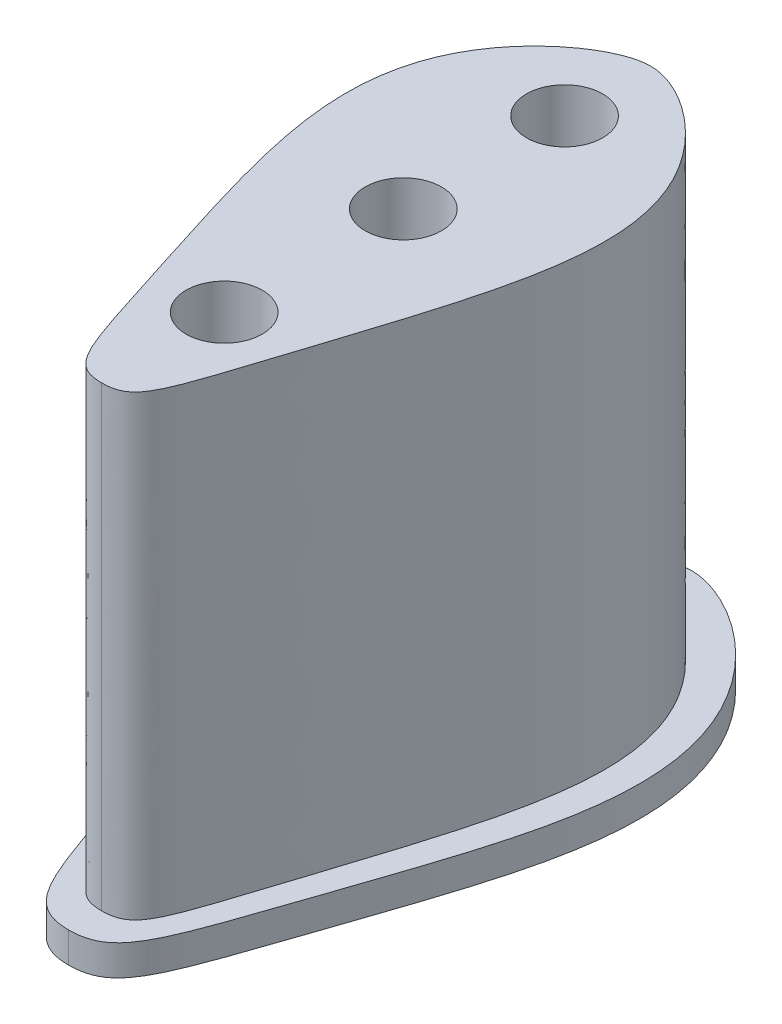
ISO-10303-21;
HEADER;
FILE_DESCRIPTION(('STEP AP214'),'2;1');
FILE_NAME('part.step','',(''),(''),'','','');
FILE_SCHEMA(('AUTOMOTIVE_DESIGN { 1 0 10303 214 1 1 1 1 }'));
ENDSEC;
DATA;
#1=APPLICATION_CONTEXT('core data for automotive mechanical design processes');
#2=APPLICATION_PROTOCOL_DEFINITION('international standard','automotive_design',2000,#1);
#3=PRODUCT_CONTEXT('',#1,'mechanical');
#4=PRODUCT('Part','Part','',(#3));
#5=PRODUCT_RELATED_PRODUCT_CATEGORY('part','',(#4));
#6=PRODUCT_DEFINITION_FORMATION('','',#4);
#7=PRODUCT_DEFINITION_CONTEXT('part definition',#1,'design');
#8=PRODUCT_DEFINITION('design','',#6,#7);
#9=PRODUCT_DEFINITION_SHAPE('','',#8);
#10=(LENGTH_UNIT() NAMED_UNIT(*) SI_UNIT(.MILLI.,.METRE.));
#11=(NAMED_UNIT(*) PLANE_ANGLE_UNIT() SI_UNIT($,.RADIAN.));
#12=(NAMED_UNIT(*) SI_UNIT($,.STERADIAN.) SOLID_ANGLE_UNIT());
#13=UNCERTAINTY_MEASURE_WITH_UNIT(LENGTH_MEASURE(1.E-05),#10,'distance_accuracy_value','');
#14=(GEOMETRIC_REPRESENTATION_CONTEXT(3) GLOBAL_UNCERTAINTY_ASSIGNED_CONTEXT((#13)) GLOBAL_UNIT_ASSIGNED_CONTEXT((#10,
#11,#12)) REPRESENTATION_CONTEXT('',''));
#15=CARTESIAN_POINT('',(0.,0.,0.));
#16=DIRECTION('',(0.,0.,1.));
#17=DIRECTION('',(1.,0.,0.));
#18=AXIS2_PLACEMENT_3D('',#15,#16,#17);
#19=CARTESIAN_POINT('',(0.12286504058619,32.,-38.2384665260502));
#20=CARTESIAN_POINT('',(-4.97587389575558,32.,-38.2414873686948));
#21=CARTESIAN_POINT('',(-13.5003142261998,32.,-27.3530555676864));
#22=CARTESIAN_POINT('',(-10.5685583705486,32.,-26.1997976414068));
#23=CARTESIAN_POINT('',(-0.852682464661893,32.,-7.55709148616971));
#24=CARTESIAN_POINT('',(-4.49606017056606,32.,-2.23526174369485));
#25=CARTESIAN_POINT('',(0.101532658938724,32.,-2.23253781437521));
#26=B_SPLINE_CURVE_WITH_KNOTS('',6,(#19,#20,#21,#22,#23,#24,#25),.UNSPECIFIED.,.F.,.F.,(7,7),
(0.,1.),.UNSPECIFIED.);
#27=DIRECTION('',(0.,-1.,0.));
#28=VECTOR('',#27,1.);
#29=SURFACE_OF_LINEAR_EXTRUSION('',#26,#28);
#30=DIRECTION('',(0.,-1.,0.));
#31=VECTOR('',#30,1.);
#32=CARTESIAN_POINT('',(0.122865040586191,32.,-38.2384665260502));
#33=LINE('',#32,#31);
#34=CARTESIAN_POINT('',(0.122865040586191,32.,-38.2384665260502));
#35=VERTEX_POINT('',#34);
#36=CARTESIAN_POINT('',(0.122865040586191,2.,-38.2384665260502));
#37=VERTEX_POINT('',#36);
#38=EDGE_CURVE('E54',#35,#37,#33,.T.);
#39=ORIENTED_EDGE('',*,*,#38,.T.);
#40=CARTESIAN_POINT('',(0.12286504058619,2.,-38.2384665260502));
#41=CARTESIAN_POINT('',(-4.97587389575558,2.,-38.2414873686948));
#42=CARTESIAN_POINT('',(-13.5003142261998,2.,-27.3530555676864));
#43=CARTESIAN_POINT('',(-10.5685583705486,2.,-26.1997976414068));
#44=CARTESIAN_POINT('',(-0.852682464661893,2.,-7.55709148616971));
#45=CARTESIAN_POINT('',(-4.49606017056606,2.,-2.23526174369485));
#46=CARTESIAN_POINT('',(0.101532658938724,2.,-2.23253781437521));
#47=B_SPLINE_CURVE_WITH_KNOTS('',6,(#40,#41,#42,#43,#44,#45,#46),.UNSPECIFIED.,.F.,.F.,(7,7),
(0.,1.),.UNSPECIFIED.);
#48=CARTESIAN_POINT('',(0.101532658938724,2.,-2.23253781437521));
#49=VERTEX_POINT('',#48);
#50=EDGE_CURVE('E88',#37,#49,#47,.T.);
#51=ORIENTED_EDGE('',*,*,#50,.T.);
#52=DIRECTION('',(0.,-1.,0.));
#53=VECTOR('',#52,1.);
#54=CARTESIAN_POINT('',(0.101532658938724,32.,-2.23253781437521));
#55=LINE('',#54,#53);
#56=CARTESIAN_POINT('',(0.101532658938724,32.,-2.23253781437521));
#57=VERTEX_POINT('',#56);
#58=EDGE_CURVE('E11',#57,#49,#55,.T.);
#59=ORIENTED_EDGE('',*,*,#58,.F.);
#60=EDGE_CURVE('E153',#35,#57,#26,.T.);
#61=ORIENTED_EDGE('',*,*,#60,.F.);
#62=EDGE_LOOP('',(#39,#51,#59,#61));
#63=FACE_BOUND('',#62,.T.);
#64=ADVANCED_FACE('F45',(#63),#29,.F.);
#65=CARTESIAN_POINT('',(0.106293025062344,32.,-10.2673370281271));
#66=DIRECTION('',(0.,-1.,0.));
#67=DIRECTION('',(0.,0.,-1.));
#68=AXIS2_PLACEMENT_3D('',#65,#66,#67);
#69=CYLINDRICAL_SURFACE('',#68,2.5);
#70=CARTESIAN_POINT('',(0.106293025062344,32.,-10.2673370281271));
#71=DIRECTION('',(0.,1.,0.));
#72=DIRECTION('',(0.,0.,1.));
#73=AXIS2_PLACEMENT_3D('',#70,#71,#72);
#74=CIRCLE('',#73,2.5);
#75=CARTESIAN_POINT('',(0.106293025062344,32.,-7.76733702812706));
#76=VERTEX_POINT('',#75);
#77=EDGE_CURVE('E152',#76,#76,#74,.T.);
#78=ORIENTED_EDGE('',*,*,#77,.T.);
#79=EDGE_LOOP('',(#78));
#80=FACE_BOUND('',#79,.T.);
#81=CARTESIAN_POINT('',(0.106293025062344,0.,-10.2673370281271));
#82=DIRECTION('',(0.,1.,0.));
#83=DIRECTION('',(0.,0.,1.));
#84=AXIS2_PLACEMENT_3D('',#81,#82,#83);
#85=CIRCLE('',#84,2.5);
#86=CARTESIAN_POINT('',(0.106293025062344,0.,-7.76733702812706));
#87=VERTEX_POINT('',#86);
#88=EDGE_CURVE('E172',#87,#87,#85,.T.);
#89=ORIENTED_EDGE('',*,*,#88,.F.);
#90=EDGE_LOOP('',(#89));
#91=FACE_BOUND('',#90,.T.);
#92=ADVANCED_FACE('F140',(#80,#91),#69,.F.);
#93=CARTESIAN_POINT('',(0.12286504058619,32.,-38.2384665260502));
#94=CARTESIAN_POINT('',(5.22160397692796,32.,-38.2354456834056));
#95=CARTESIAN_POINT('',(13.7331362198504,32.,-27.3369206038269));
#96=CARTESIAN_POINT('',(10.8000158846981,32.,-26.1871374324472));
#97=CARTESIAN_POINT('',(1.06205637199252,32.,-7.55595706355988));
#98=CARTESIAN_POINT('',(4.69912548844351,32.,-2.22981388505557));
#99=CARTESIAN_POINT('',(0.101532658938724,32.,-2.23253781437521));
#100=B_SPLINE_CURVE_WITH_KNOTS('',6,(#93,#94,#95,#96,#97,#98,#99),.UNSPECIFIED.,.F.,.F.,(7,7),
(0.,1.),.UNSPECIFIED.);
#101=DIRECTION('',(0.,-1.,0.));
#102=VECTOR('',#101,1.);
#103=SURFACE_OF_LINEAR_EXTRUSION('',#100,#102);
#104=CARTESIAN_POINT('',(0.12286504058619,2.,-38.2384665260502));
#105=CARTESIAN_POINT('',(5.22160397692796,2.,-38.2354456834056));
#106=CARTESIAN_POINT('',(13.7331362198504,2.,-27.3369206038269));
#107=CARTESIAN_POINT('',(10.8000158846981,2.,-26.1871374324472));
#108=CARTESIAN_POINT('',(1.06205637199252,2.,-7.55595706355988));
#109=CARTESIAN_POINT('',(4.69912548844351,2.,-2.22981388505557));
#110=CARTESIAN_POINT('',(0.101532658938724,2.,-2.23253781437521));
#111=B_SPLINE_CURVE_WITH_KNOTS('',6,(#104,#105,#106,#107,#108,#109,#110),.UNSPECIFIED.,.F.,.F.,
(7,7),(0.,1.),.UNSPECIFIED.);
#112=EDGE_CURVE('E60',#37,#49,#111,.T.);
#113=ORIENTED_EDGE('',*,*,#112,.F.);
#114=ORIENTED_EDGE('',*,*,#38,.F.);
#115=EDGE_CURVE('E85',#35,#57,#100,.T.);
#116=ORIENTED_EDGE('',*,*,#115,.T.);
#117=ORIENTED_EDGE('',*,*,#58,.T.);
#118=EDGE_LOOP('',(#113,#114,#116,#117));
#119=FACE_BOUND('',#118,.T.);
#120=ADVANCED_FACE('F83',(#119),#103,.T.);
#121=CARTESIAN_POINT('',(0.119516457624504,32.,-32.5865500454572));
#122=DIRECTION('',(0.,-1.,0.));
#123=DIRECTION('',(0.,0.,-1.));
#124=AXIS2_PLACEMENT_3D('',#121,#122,#123);
#125=CYLINDRICAL_SURFACE('',#124,2.5);
#126=CARTESIAN_POINT('',(0.119516457624504,32.,-32.5865500454572));
#127=DIRECTION('',(0.,1.,0.));
#128=DIRECTION('',(0.,0.,1.));
#129=AXIS2_PLACEMENT_3D('',#126,#127,#128);
#130=CIRCLE('',#129,2.5);
#131=CARTESIAN_POINT('',(0.119516457624504,32.,-30.0865500454572));
#132=VERTEX_POINT('',#131);
#133=EDGE_CURVE('E180',#132,#132,#130,.T.);
#134=ORIENTED_EDGE('',*,*,#133,.T.);
#135=EDGE_LOOP('',(#134));
#136=FACE_BOUND('',#135,.T.);
#137=CARTESIAN_POINT('',(0.119516457624504,0.,-32.5865500454572));
#138=DIRECTION('',(0.,1.,0.));
#139=DIRECTION('',(0.,0.,1.));
#140=AXIS2_PLACEMENT_3D('',#137,#138,#139);
#141=CIRCLE('',#140,2.5);
#142=CARTESIAN_POINT('',(0.119516457624504,0.,-30.0865500454572));
#143=VERTEX_POINT('',#142);
#144=EDGE_CURVE('E168',#143,#143,#141,.T.);
#145=ORIENTED_EDGE('',*,*,#144,.F.);
#146=EDGE_LOOP('',(#145));
#147=FACE_BOUND('',#146,.T.);
#148=ADVANCED_FACE('F47',(#136,#147),#125,.F.);
#149=CARTESIAN_POINT('',(0.113251364753859,32.,-22.0119929706604));
#150=DIRECTION('',(0.,-1.,0.));
#151=DIRECTION('',(0.,0.,-1.));
#152=AXIS2_PLACEMENT_3D('',#149,#150,#151);
#153=CYLINDRICAL_SURFACE('',#152,2.5);
#154=CARTESIAN_POINT('',(0.113251364753859,32.,-22.0119929706604));
#155=DIRECTION('',(0.,1.,0.));
#156=DIRECTION('',(0.,0.,1.));
#157=AXIS2_PLACEMENT_3D('',#154,#155,#156);
#158=CIRCLE('',#157,2.5);
#159=CARTESIAN_POINT('',(0.113251364753859,32.,-19.5119929706604));
#160=VERTEX_POINT('',#159);
#161=EDGE_CURVE('E164',#160,#160,#158,.T.);
#162=ORIENTED_EDGE('',*,*,#161,.T.);
#163=EDGE_LOOP('',(#162));
#164=FACE_BOUND('',#163,.T.);
#165=CARTESIAN_POINT('',(0.113251364753859,0.,-22.0119929706604));
#166=DIRECTION('',(0.,1.,0.));
#167=DIRECTION('',(0.,0.,1.));
#168=AXIS2_PLACEMENT_3D('',#165,#166,#167);
#169=CIRCLE('',#168,2.5);
#170=CARTESIAN_POINT('',(0.113251364753859,0.,-19.5119929706604));
#171=VERTEX_POINT('',#170);
#172=EDGE_CURVE('E177',#171,#171,#169,.T.);
#173=ORIENTED_EDGE('',*,*,#172,.F.);
#174=EDGE_LOOP('',(#173));
#175=FACE_BOUND('',#174,.T.);
#176=ADVANCED_FACE('F132',(#164,#175),#153,.F.);
#177=CARTESIAN_POINT('',(0.,32.,0.));
#178=DIRECTION('',(0.,1.,0.));
#179=DIRECTION('',(0.,0.,1.));
#180=AXIS2_PLACEMENT_3D('',#177,#178,#179);
#181=PLANE('',#180);
#182=ORIENTED_EDGE('',*,*,#133,.F.);
#183=EDGE_LOOP('',(#182));
#184=FACE_BOUND('',#183,.T.);
#185=ORIENTED_EDGE('',*,*,#60,.T.);
#186=ORIENTED_EDGE('',*,*,#115,.F.);
#187=EDGE_LOOP('',(#185,#186));
#188=FACE_BOUND('',#187,.T.);
#189=ORIENTED_EDGE('',*,*,#77,.F.);
#190=EDGE_LOOP('',(#189));
#191=FACE_BOUND('',#190,.T.);
#192=ORIENTED_EDGE('',*,*,#161,.F.);
#193=EDGE_LOOP('',(#192));
#194=FACE_BOUND('',#193,.T.);
#195=ADVANCED_FACE('F129',(#184,#188,#191,#194),#181,.T.);
#196=CARTESIAN_POINT('',(0.,0.,0.));
#197=DIRECTION('',(0.,1.,0.));
#198=DIRECTION('',(0.,0.,1.));
#199=AXIS2_PLACEMENT_3D('',#196,#197,#198);
#200=PLANE('',#199);
#201=ORIENTED_EDGE('',*,*,#144,.T.);
#202=EDGE_LOOP('',(#201));
#203=FACE_BOUND('',#202,.T.);
#204=ORIENTED_EDGE('',*,*,#88,.T.);
#205=EDGE_LOOP('',(#204));
#206=FACE_BOUND('',#205,.T.);
#207=ORIENTED_EDGE('',*,*,#172,.T.);
#208=EDGE_LOOP('',(#207));
#209=FACE_BOUND('',#208,.T.);
#210=CARTESIAN_POINT('',(0.124452183934537,0.,-40.917331511693));
#211=CARTESIAN_POINT('',(6.17279312322754,0.,-40.9137480596931));
#212=CARTESIAN_POINT('',(21.5830913649793,0.,-26.9680854606389));
#213=CARTESIAN_POINT('',(4.78498692354374,0.,-20.8059839368501));
#214=CARTESIAN_POINT('',(9.65095529307126,0.,-11.8158030364155));
#215=CARTESIAN_POINT('',(2.70130364402917,0.,-5.79162212799365));
#216=CARTESIAN_POINT('',(5.31185129578458,0.,-0.0637869915474992));
#217=CARTESIAN_POINT('',(0.100249571578134,0.,-0.0668747018483672));
#218=B_SPLINE_CURVE_WITH_KNOTS('',7,(#210,#211,#212,#213,#214,#215,#216,#217),.UNSPECIFIED.,.F.,
.F.,(8,8),(0.,1.),.UNSPECIFIED.);
#219=CARTESIAN_POINT('',(0.124452183934537,0.,-40.917331511693));
#220=VERTEX_POINT('',#219);
#221=CARTESIAN_POINT('',(0.100249571578134,0.,-0.0668747018483672));
#222=VERTEX_POINT('',#221);
#223=EDGE_CURVE('E199',#220,#222,#218,.T.);
#224=ORIENTED_EDGE('',*,*,#223,.T.);
#225=CARTESIAN_POINT('',(0.124452183934537,0.,-40.917331511693));
#226=CARTESIAN_POINT('',(-5.92388875535846,0.,-40.920914963693));
#227=CARTESIAN_POINT('',(-21.3507009066811,0.,-26.9935223838092));
#228=CARTESIAN_POINT('',(-4.55990995873176,0.,-20.8115204946861));
#229=CARTESIAN_POINT('',(-9.43652770794617,0.,-11.8271117704667));
#230=CARTESIAN_POINT('',(-2.49401921119781,0.,-5.79470019357605));
#231=CARTESIAN_POINT('',(-5.11135215262831,0.,-0.0699624121492358));
#232=CARTESIAN_POINT('',(0.100249571578134,0.,-0.0668747018483672));
#233=B_SPLINE_CURVE_WITH_KNOTS('',7,(#225,#226,#227,#228,#229,#230,#231,#232),.UNSPECIFIED.,.F.,
.F.,(8,8),(0.,1.),.UNSPECIFIED.);
#234=EDGE_CURVE('E91',#220,#222,#233,.T.);
#235=ORIENTED_EDGE('',*,*,#234,.F.);
#236=EDGE_LOOP('',(#224,#235));
#237=FACE_BOUND('',#236,.T.);
#238=ADVANCED_FACE('F126',(#203,#206,#209,#237),#200,.F.);
#239=CARTESIAN_POINT('',(0.124452183934537,2.,-40.917331511693));
#240=CARTESIAN_POINT('',(6.17279312322754,2.,-40.9137480596931));
#241=CARTESIAN_POINT('',(21.5830913649793,2.,-26.9680854606389));
#242=CARTESIAN_POINT('',(4.78498692354374,2.,-20.8059839368501));
#243=CARTESIAN_POINT('',(9.65095529307126,2.,-11.8158030364155));
#244=CARTESIAN_POINT('',(2.70130364402917,2.,-5.79162212799365));
#245=CARTESIAN_POINT('',(5.31185129578458,2.,-0.0637869915474992));
#246=CARTESIAN_POINT('',(0.100249571578134,2.,-0.0668747018483672));
#247=B_SPLINE_CURVE_WITH_KNOTS('',7,(#239,#240,#241,#242,#243,#244,#245,#246),.UNSPECIFIED.,.F.,
.F.,(8,8),(0.,1.),.UNSPECIFIED.);
#248=DIRECTION('',(0.,-1.,0.));
#249=VECTOR('',#248,1.);
#250=SURFACE_OF_LINEAR_EXTRUSION('',#247,#249);
#251=ORIENTED_EDGE('',*,*,#223,.F.);
#252=DIRECTION('',(0.,-1.,0.));
#253=VECTOR('',#252,1.);
#254=CARTESIAN_POINT('',(0.124452183934537,2.,-40.917331511693));
#255=LINE('',#254,#253);
#256=CARTESIAN_POINT('',(0.124452183934537,2.,-40.917331511693));
#257=VERTEX_POINT('',#256);
#258=EDGE_CURVE('E173',#257,#220,#255,.T.);
#259=ORIENTED_EDGE('',*,*,#258,.F.);
#260=CARTESIAN_POINT('',(0.100249571578134,2.,-0.0668747018483672));
#261=VERTEX_POINT('',#260);
#262=EDGE_CURVE('E96',#257,#261,#247,.T.);
#263=ORIENTED_EDGE('',*,*,#262,.T.);
#264=DIRECTION('',(0.,-1.,0.));
#265=VECTOR('',#264,1.);
#266=CARTESIAN_POINT('',(0.100249571578134,2.,-0.0668747018483672));
#267=LINE('',#266,#265);
#268=EDGE_CURVE('E187',#261,#222,#267,.T.);
#269=ORIENTED_EDGE('',*,*,#268,.T.);
#270=EDGE_LOOP('',(#251,#259,#263,#269));
#271=FACE_BOUND('',#270,.T.);
#272=ADVANCED_FACE('F121',(#271),#250,.T.);
#273=CARTESIAN_POINT('',(0.124452183934537,2.,-40.917331511693));
#274=CARTESIAN_POINT('',(-5.92388875535846,2.,-40.920914963693));
#275=CARTESIAN_POINT('',(-21.3507009066811,2.,-26.9935223838092));
#276=CARTESIAN_POINT('',(-4.55990995873176,2.,-20.8115204946861));
#277=CARTESIAN_POINT('',(-9.43652770794617,2.,-11.8271117704667));
#278=CARTESIAN_POINT('',(-2.49401921119781,2.,-5.79470019357605));
#279=CARTESIAN_POINT('',(-5.11135215262831,2.,-0.0699624121492358));
#280=CARTESIAN_POINT('',(0.100249571578134,2.,-0.0668747018483672));
#281=B_SPLINE_CURVE_WITH_KNOTS('',7,(#273,#274,#275,#276,#277,#278,#279,#280),.UNSPECIFIED.,.F.,
.F.,(8,8),(0.,1.),.UNSPECIFIED.);
#282=DIRECTION('',(0.,-1.,0.));
#283=VECTOR('',#282,1.);
#284=SURFACE_OF_LINEAR_EXTRUSION('',#281,#283);
#285=ORIENTED_EDGE('',*,*,#234,.T.);
#286=ORIENTED_EDGE('',*,*,#268,.F.);
#287=EDGE_CURVE('E100',#257,#261,#281,.T.);
#288=ORIENTED_EDGE('',*,*,#287,.F.);
#289=ORIENTED_EDGE('',*,*,#258,.T.);
#290=EDGE_LOOP('',(#285,#286,#288,#289));
#291=FACE_BOUND('',#290,.T.);
#292=ADVANCED_FACE('F125',(#291),#284,.F.);
#293=CARTESIAN_POINT('',(0.,2.,0.));
#294=DIRECTION('',(0.,1.,0.));
#295=DIRECTION('',(0.,0.,1.));
#296=AXIS2_PLACEMENT_3D('',#293,#294,#295);
#297=PLANE('',#296);
#298=ORIENTED_EDGE('',*,*,#50,.F.);
#299=ORIENTED_EDGE('',*,*,#112,.T.);
#300=EDGE_LOOP('',(#298,#299));
#301=FACE_BOUND('',#300,.T.);
#302=ORIENTED_EDGE('',*,*,#262,.F.);
#303=ORIENTED_EDGE('',*,*,#287,.T.);
#304=EDGE_LOOP('',(#302,#303));
#305=FACE_BOUND('',#304,.T.);
#306=ADVANCED_FACE('F93',(#301,#305),#297,.T.);
#307=CLOSED_SHELL('',(#64,#92,#120,#148,#176,#195,#238,#272,#292,#306));
#308=MANIFOLD_SOLID_BREP('B2',#307);
#309=ADVANCED_BREP_SHAPE_REPRESENTATION('',(#18,#308),#14);
#310=SHAPE_DEFINITION_REPRESENTATION(#9,#309);
ENDSEC;
END-ISO-10303-21;
